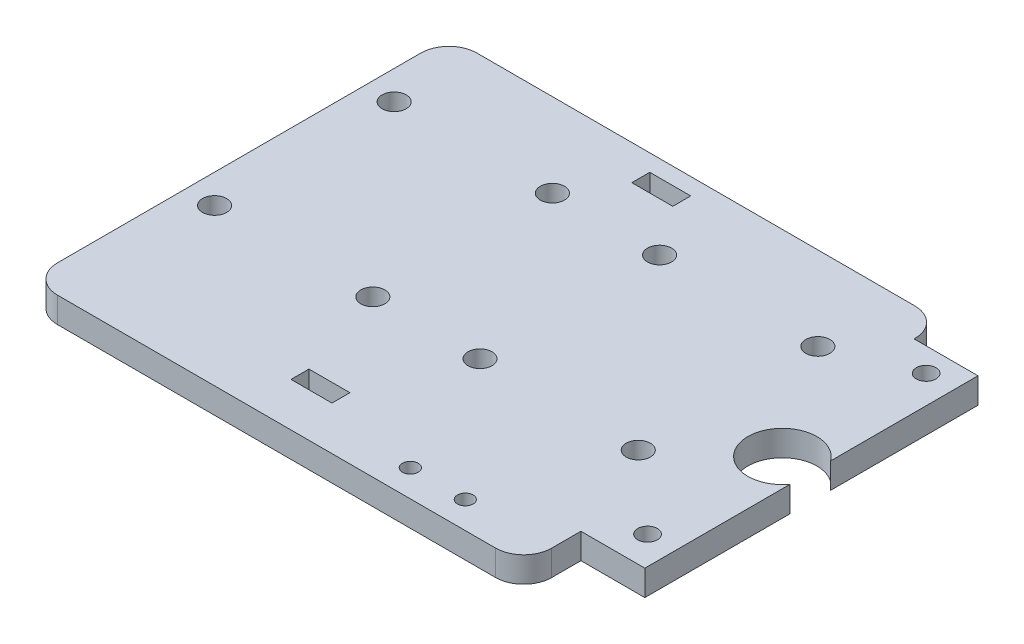
ISO-10303-21;
HEADER;
FILE_DESCRIPTION(('STEP AP214'),'2;1');
FILE_NAME('part.step','',(''),(''),'','','');
FILE_SCHEMA(('AUTOMOTIVE_DESIGN { 1 0 10303 214 1 1 1 1 }'));
ENDSEC;
DATA;
#1=APPLICATION_CONTEXT('core data for automotive mechanical design processes');
#2=APPLICATION_PROTOCOL_DEFINITION('international standard','automotive_design',2000,#1);
#3=PRODUCT_CONTEXT('',#1,'mechanical');
#4=PRODUCT('Part','Part','',(#3));
#5=PRODUCT_RELATED_PRODUCT_CATEGORY('part','',(#4));
#6=PRODUCT_DEFINITION_FORMATION('','',#4);
#7=PRODUCT_DEFINITION_CONTEXT('part definition',#1,'design');
#8=PRODUCT_DEFINITION('design','',#6,#7);
#9=PRODUCT_DEFINITION_SHAPE('','',#8);
#10=(LENGTH_UNIT() NAMED_UNIT(*) SI_UNIT(.MILLI.,.METRE.));
#11=(NAMED_UNIT(*) PLANE_ANGLE_UNIT() SI_UNIT($,.RADIAN.));
#12=(NAMED_UNIT(*) SI_UNIT($,.STERADIAN.) SOLID_ANGLE_UNIT());
#13=UNCERTAINTY_MEASURE_WITH_UNIT(LENGTH_MEASURE(1.E-05),#10,'distance_accuracy_value','');
#14=(GEOMETRIC_REPRESENTATION_CONTEXT(3) GLOBAL_UNCERTAINTY_ASSIGNED_CONTEXT((#13)) GLOBAL_UNIT_ASSIGNED_CONTEXT((#10,
#11,#12)) REPRESENTATION_CONTEXT('',''));
#15=CARTESIAN_POINT('',(0.,0.,0.));
#16=DIRECTION('',(0.,0.,1.));
#17=DIRECTION('',(1.,0.,0.));
#18=AXIS2_PLACEMENT_3D('',#15,#16,#17);
#19=CARTESIAN_POINT('',(109.36,4.55,-15.2));
#20=DIRECTION('',(0.,-1.,0.));
#21=DIRECTION('',(0.,0.,-1.));
#22=AXIS2_PLACEMENT_3D('',#19,#20,#21);
#23=PLANE('',#22);
#24=DIRECTION('',(0.,0.,1.));
#25=VECTOR('',#24,1.);
#26=CARTESIAN_POINT('',(38.8,4.55,-71.73));
#27=LINE('',#26,#25);
#28=CARTESIAN_POINT('',(38.8,4.55,-71.73));
#29=VERTEX_POINT('',#28);
#30=CARTESIAN_POINT('',(38.8,4.55,-68.53));
#31=VERTEX_POINT('',#30);
#32=EDGE_CURVE('E324',#29,#31,#27,.T.);
#33=ORIENTED_EDGE('',*,*,#32,.F.);
#34=DIRECTION('',(-1.,0.,0.));
#35=VECTOR('',#34,1.);
#36=CARTESIAN_POINT('',(38.8,4.55,-71.73));
#37=LINE('',#36,#35);
#38=CARTESIAN_POINT('',(46.1,4.55,-71.73));
#39=VERTEX_POINT('',#38);
#40=EDGE_CURVE('E332',#39,#29,#37,.T.);
#41=ORIENTED_EDGE('',*,*,#40,.F.);
#42=DIRECTION('',(0.,0.,-1.));
#43=VECTOR('',#42,1.);
#44=CARTESIAN_POINT('',(46.1,4.55,-71.73));
#45=LINE('',#44,#43);
#46=CARTESIAN_POINT('',(46.1,4.55,-68.53));
#47=VERTEX_POINT('',#46);
#48=EDGE_CURVE('E329',#47,#39,#45,.T.);
#49=ORIENTED_EDGE('',*,*,#48,.F.);
#50=DIRECTION('',(1.,0.,0.));
#51=VECTOR('',#50,1.);
#52=CARTESIAN_POINT('',(38.8,4.55,-68.53));
#53=LINE('',#52,#51);
#54=EDGE_CURVE('E326',#31,#47,#53,.T.);
#55=ORIENTED_EDGE('',*,*,#54,.F.);
#56=EDGE_LOOP('',(#33,#41,#49,#55));
#57=FACE_BOUND('',#56,.T.);
#58=CARTESIAN_POINT('',(5.15,4.55,-59.83));
#59=DIRECTION('',(0.,1.,0.));
#60=DIRECTION('',(0.,0.,1.));
#61=AXIS2_PLACEMENT_3D('',#58,#59,#60);
#62=CIRCLE('',#61,2.15);
#63=CARTESIAN_POINT('',(5.15,4.55,-57.68));
#64=VERTEX_POINT('',#63);
#65=EDGE_CURVE('E230',#64,#64,#62,.T.);
#66=ORIENTED_EDGE('',*,*,#65,.F.);
#67=EDGE_LOOP('',(#66));
#68=FACE_BOUND('',#67,.T.);
#69=CARTESIAN_POINT('',(33.35,4.55,-59.83));
#70=DIRECTION('',(0.,1.,0.));
#71=DIRECTION('',(0.,0.,1.));
#72=AXIS2_PLACEMENT_3D('',#69,#70,#71);
#73=CIRCLE('',#72,2.15000000000001);
#74=CARTESIAN_POINT('',(33.35,4.55,-57.68));
#75=VERTEX_POINT('',#74);
#76=EDGE_CURVE('E391',#75,#75,#73,.T.);
#77=ORIENTED_EDGE('',*,*,#76,.F.);
#78=EDGE_LOOP('',(#77));
#79=FACE_BOUND('',#78,.T.);
#80=CARTESIAN_POINT('',(52.45,4.55,-59.83));
#81=DIRECTION('',(0.,1.,0.));
#82=DIRECTION('',(0.,0.,1.));
#83=AXIS2_PLACEMENT_3D('',#80,#81,#82);
#84=CIRCLE('',#83,2.15);
#85=CARTESIAN_POINT('',(52.45,4.55,-57.68));
#86=VERTEX_POINT('',#85);
#87=EDGE_CURVE('E385',#86,#86,#84,.T.);
#88=ORIENTED_EDGE('',*,*,#87,.F.);
#89=EDGE_LOOP('',(#88));
#90=FACE_BOUND('',#89,.T.);
#91=CARTESIAN_POINT('',(80.65,4.55,-59.83));
#92=DIRECTION('',(0.,1.,0.));
#93=DIRECTION('',(0.,0.,1.));
#94=AXIS2_PLACEMENT_3D('',#91,#92,#93);
#95=CIRCLE('',#94,2.15);
#96=CARTESIAN_POINT('',(80.65,4.55,-57.68));
#97=VERTEX_POINT('',#96);
#98=EDGE_CURVE('E379',#97,#97,#95,.T.);
#99=ORIENTED_EDGE('',*,*,#98,.F.);
#100=EDGE_LOOP('',(#99));
#101=FACE_BOUND('',#100,.T.);
#102=CARTESIAN_POINT('',(5.15000000000034,4.55,-27.83));
#103=DIRECTION('',(0.,1.,0.));
#104=DIRECTION('',(0.,0.,1.));
#105=AXIS2_PLACEMENT_3D('',#102,#103,#104);
#106=CIRCLE('',#105,2.15);
#107=CARTESIAN_POINT('',(5.15000000000034,4.55,-25.68));
#108=VERTEX_POINT('',#107);
#109=EDGE_CURVE('E373',#108,#108,#106,.T.);
#110=ORIENTED_EDGE('',*,*,#109,.F.);
#111=EDGE_LOOP('',(#110));
#112=FACE_BOUND('',#111,.T.);
#113=CARTESIAN_POINT('',(33.3500000000003,4.55,-27.83));
#114=DIRECTION('',(0.,1.,0.));
#115=DIRECTION('',(0.,0.,1.));
#116=AXIS2_PLACEMENT_3D('',#113,#114,#115);
#117=CIRCLE('',#116,2.15000000000001);
#118=CARTESIAN_POINT('',(33.3500000000003,4.55,-25.68));
#119=VERTEX_POINT('',#118);
#120=EDGE_CURVE('E367',#119,#119,#117,.T.);
#121=ORIENTED_EDGE('',*,*,#120,.F.);
#122=EDGE_LOOP('',(#121));
#123=FACE_BOUND('',#122,.T.);
#124=CARTESIAN_POINT('',(52.4500000000003,4.55,-27.83));
#125=DIRECTION('',(0.,1.,0.));
#126=DIRECTION('',(0.,0.,1.));
#127=AXIS2_PLACEMENT_3D('',#124,#125,#126);
#128=CIRCLE('',#127,2.15);
#129=CARTESIAN_POINT('',(52.4500000000003,4.55,-25.68));
#130=VERTEX_POINT('',#129);
#131=EDGE_CURVE('E361',#130,#130,#128,.T.);
#132=ORIENTED_EDGE('',*,*,#131,.F.);
#133=EDGE_LOOP('',(#132));
#134=FACE_BOUND('',#133,.T.);
#135=CARTESIAN_POINT('',(80.6500000000003,4.55,-27.83));
#136=DIRECTION('',(0.,1.,0.));
#137=DIRECTION('',(0.,0.,1.));
#138=AXIS2_PLACEMENT_3D('',#135,#136,#137);
#139=CIRCLE('',#138,2.15);
#140=CARTESIAN_POINT('',(80.6500000000003,4.55,-25.68));
#141=VERTEX_POINT('',#140);
#142=EDGE_CURVE('E355',#141,#141,#139,.T.);
#143=ORIENTED_EDGE('',*,*,#142,.F.);
#144=EDGE_LOOP('',(#143));
#145=FACE_BOUND('',#144,.T.);
#146=DIRECTION('',(0.,0.,1.));
#147=VECTOR('',#146,1.);
#148=CARTESIAN_POINT('',(38.8,4.55,-11.));
#149=LINE('',#148,#147);
#150=CARTESIAN_POINT('',(38.8,4.55,-11.));
#151=VERTEX_POINT('',#150);
#152=CARTESIAN_POINT('',(38.8,4.55,-7.8));
#153=VERTEX_POINT('',#152);
#154=EDGE_CURVE('E296',#151,#153,#149,.T.);
#155=ORIENTED_EDGE('',*,*,#154,.F.);
#156=DIRECTION('',(-1.,0.,0.));
#157=VECTOR('',#156,1.);
#158=CARTESIAN_POINT('',(38.8,4.55,-11.));
#159=LINE('',#158,#157);
#160=CARTESIAN_POINT('',(46.1,4.55,-11.));
#161=VERTEX_POINT('',#160);
#162=EDGE_CURVE('E304',#161,#151,#159,.T.);
#163=ORIENTED_EDGE('',*,*,#162,.F.);
#164=DIRECTION('',(0.,0.,-1.));
#165=VECTOR('',#164,1.);
#166=CARTESIAN_POINT('',(46.1,4.55,-11.));
#167=LINE('',#166,#165);
#168=CARTESIAN_POINT('',(46.1,4.55,-7.8));
#169=VERTEX_POINT('',#168);
#170=EDGE_CURVE('E301',#169,#161,#167,.T.);
#171=ORIENTED_EDGE('',*,*,#170,.F.);
#172=DIRECTION('',(1.,0.,0.));
#173=VECTOR('',#172,1.);
#174=CARTESIAN_POINT('',(38.8,4.55,-7.8));
#175=LINE('',#174,#173);
#176=EDGE_CURVE('E298',#153,#169,#175,.T.);
#177=ORIENTED_EDGE('',*,*,#176,.F.);
#178=EDGE_LOOP('',(#155,#163,#171,#177));
#179=FACE_BOUND('',#178,.T.);
#180=DIRECTION('',(1.,0.,0.));
#181=VECTOR('',#180,1.);
#182=CARTESIAN_POINT('',(109.36,4.55,-10.2));
#183=LINE('',#182,#181);
#184=CARTESIAN_POINT('',(88.06,4.55,-10.2));
#185=VERTEX_POINT('',#184);
#186=CARTESIAN_POINT('',(99.4499999999995,4.55,-10.2));
#187=VERTEX_POINT('',#186);
#188=EDGE_CURVE('E204',#185,#187,#183,.T.);
#189=ORIENTED_EDGE('',*,*,#188,.T.);
#190=DIRECTION('',(0.,0.,1.));
#191=VECTOR('',#190,1.);
#192=CARTESIAN_POINT('',(99.4499999999995,4.55,0.));
#193=LINE('',#192,#191);
#194=CARTESIAN_POINT('',(99.4499999999995,4.55,-36.0813853073506));
#195=VERTEX_POINT('',#194);
#196=EDGE_CURVE('E197',#195,#187,#193,.T.);
#197=ORIENTED_EDGE('',*,*,#196,.F.);
#198=CARTESIAN_POINT('',(94.47,4.55,-39.69));
#199=DIRECTION('',(0.,1.,0.));
#200=DIRECTION('',(0.,0.,1.));
#201=AXIS2_PLACEMENT_3D('',#198,#199,#200);
#202=CIRCLE('',#201,6.15000000000001);
#203=CARTESIAN_POINT('',(99.4499999999995,4.55,-43.2986146926494));
#204=VERTEX_POINT('',#203);
#205=EDGE_CURVE('E196',#204,#195,#202,.T.);
#206=ORIENTED_EDGE('',*,*,#205,.F.);
#207=CARTESIAN_POINT('',(99.4499999999995,4.55,-69.57));
#208=VERTEX_POINT('',#207);
#209=EDGE_CURVE('E55',#208,#204,#193,.T.);
#210=ORIENTED_EDGE('',*,*,#209,.F.);
#211=DIRECTION('',(-1.,0.,0.));
#212=VECTOR('',#211,1.);
#213=CARTESIAN_POINT('',(88.06,4.55,-69.57));
#214=LINE('',#213,#212);
#215=CARTESIAN_POINT('',(88.06,4.55,-69.57));
#216=VERTEX_POINT('',#215);
#217=EDGE_CURVE('E192',#208,#216,#214,.T.);
#218=ORIENTED_EDGE('',*,*,#217,.T.);
#219=DIRECTION('',(0.,0.,-1.));
#220=VECTOR('',#219,1.);
#221=CARTESIAN_POINT('',(88.06,4.55,-69.57));
#222=LINE('',#221,#220);
#223=CARTESIAN_POINT('',(88.06,4.55,-69.73));
#224=VERTEX_POINT('',#223);
#225=EDGE_CURVE('E203',#216,#224,#222,.T.);
#226=ORIENTED_EDGE('',*,*,#225,.T.);
#227=CARTESIAN_POINT('',(83.06,4.55,-69.73));
#228=DIRECTION('',(0.,1.,0.));
#229=DIRECTION('',(0.,0.,1.));
#230=AXIS2_PLACEMENT_3D('',#227,#228,#229);
#231=CIRCLE('',#230,5.);
#232=CARTESIAN_POINT('',(83.06,4.55,-74.73));
#233=VERTEX_POINT('',#232);
#234=EDGE_CURVE('E206',#224,#233,#231,.T.);
#235=ORIENTED_EDGE('',*,*,#234,.T.);
#236=DIRECTION('',(-1.,0.,0.));
#237=VECTOR('',#236,1.);
#238=CARTESIAN_POINT('',(5.00000000000004,4.55,-74.73));
#239=LINE('',#238,#237);
#240=CARTESIAN_POINT('',(5.00000000000004,4.55,-74.73));
#241=VERTEX_POINT('',#240);
#242=EDGE_CURVE('E213',#233,#241,#239,.T.);
#243=ORIENTED_EDGE('',*,*,#242,.T.);
#244=CARTESIAN_POINT('',(5.,4.55,-69.73));
#245=DIRECTION('',(0.,1.,0.));
#246=DIRECTION('',(0.,0.,-1.));
#247=AXIS2_PLACEMENT_3D('',#244,#245,#246);
#248=CIRCLE('',#247,5.);
#249=CARTESIAN_POINT('',(0.,4.55,-69.73));
#250=VERTEX_POINT('',#249);
#251=EDGE_CURVE('E215',#241,#250,#248,.T.);
#252=ORIENTED_EDGE('',*,*,#251,.T.);
#253=DIRECTION('',(0.,0.,1.));
#254=VECTOR('',#253,1.);
#255=CARTESIAN_POINT('',(0.,4.55,-5.00000000000004));
#256=LINE('',#255,#254);
#257=CARTESIAN_POINT('',(0.,4.55,-5.00000000000004));
#258=VERTEX_POINT('',#257);
#259=EDGE_CURVE('E217',#250,#258,#256,.T.);
#260=ORIENTED_EDGE('',*,*,#259,.T.);
#261=CARTESIAN_POINT('',(5.,4.55,-5.));
#262=DIRECTION('',(0.,1.,0.));
#263=DIRECTION('',(0.,0.,-1.));
#264=AXIS2_PLACEMENT_3D('',#261,#262,#263);
#265=CIRCLE('',#264,5.);
#266=CARTESIAN_POINT('',(5.00000000000004,4.55,0.));
#267=VERTEX_POINT('',#266);
#268=EDGE_CURVE('E219',#258,#267,#265,.T.);
#269=ORIENTED_EDGE('',*,*,#268,.T.);
#270=DIRECTION('',(1.,0.,0.));
#271=VECTOR('',#270,1.);
#272=CARTESIAN_POINT('',(5.00000000000004,4.55,0.));
#273=LINE('',#272,#271);
#274=CARTESIAN_POINT('',(83.06,4.55,0.));
#275=VERTEX_POINT('',#274);
#276=EDGE_CURVE('E221',#267,#275,#273,.T.);
#277=ORIENTED_EDGE('',*,*,#276,.T.);
#278=CARTESIAN_POINT('',(83.06,4.55,-5.));
#279=DIRECTION('',(0.,1.,0.));
#280=DIRECTION('',(0.,0.,1.));
#281=AXIS2_PLACEMENT_3D('',#278,#279,#280);
#282=CIRCLE('',#281,5.);
#283=CARTESIAN_POINT('',(88.06,4.55,-5.00000000000004));
#284=VERTEX_POINT('',#283);
#285=EDGE_CURVE('E223',#275,#284,#282,.T.);
#286=ORIENTED_EDGE('',*,*,#285,.T.);
#287=DIRECTION('',(0.,0.,-1.));
#288=VECTOR('',#287,1.);
#289=CARTESIAN_POINT('',(88.06,4.55,-5.00000000000004));
#290=LINE('',#289,#288);
#291=EDGE_CURVE('E208',#284,#185,#290,.T.);
#292=ORIENTED_EDGE('',*,*,#291,.T.);
#293=EDGE_LOOP('',(#189,#197,#206,#210,#218,#226,#235,#243,#252,#260,#269,#277,#286,#292));
#294=FACE_BOUND('',#293,.T.);
#295=CARTESIAN_POINT('',(94.4499999999995,4.55,-65.33));
#296=DIRECTION('',(0.,1.,0.));
#297=DIRECTION('',(0.,0.,1.));
#298=AXIS2_PLACEMENT_3D('',#295,#296,#297);
#299=CIRCLE('',#298,1.75);
#300=CARTESIAN_POINT('',(94.4499999999995,4.55,-63.58));
#301=VERTEX_POINT('',#300);
#302=EDGE_CURVE('E290',#301,#301,#299,.T.);
#303=ORIENTED_EDGE('',*,*,#302,.F.);
#304=EDGE_LOOP('',(#303));
#305=FACE_BOUND('',#304,.T.);
#306=CARTESIAN_POINT('',(94.45,4.55,-15.69));
#307=DIRECTION('',(0.,1.,0.));
#308=DIRECTION('',(0.,0.,1.));
#309=AXIS2_PLACEMENT_3D('',#306,#307,#308);
#310=CIRCLE('',#309,1.75);
#311=CARTESIAN_POINT('',(94.45,4.55,-13.94));
#312=VERTEX_POINT('',#311);
#313=EDGE_CURVE('E423',#312,#312,#310,.T.);
#314=ORIENTED_EDGE('',*,*,#313,.F.);
#315=EDGE_LOOP('',(#314));
#316=FACE_BOUND('',#315,.T.);
#317=CARTESIAN_POINT('',(63.06,4.55,-4.8));
#318=DIRECTION('',(0.,1.,0.));
#319=DIRECTION('',(0.,0.,1.));
#320=AXIS2_PLACEMENT_3D('',#317,#318,#319);
#321=CIRCLE('',#320,1.4);
#322=CARTESIAN_POINT('',(63.06,4.55,-3.4));
#323=VERTEX_POINT('',#322);
#324=EDGE_CURVE('E417',#323,#323,#321,.T.);
#325=ORIENTED_EDGE('',*,*,#324,.F.);
#326=EDGE_LOOP('',(#325));
#327=FACE_BOUND('',#326,.T.);
#328=CARTESIAN_POINT('',(72.86,4.55,-4.8));
#329=DIRECTION('',(0.,1.,0.));
#330=DIRECTION('',(0.,0.,1.));
#331=AXIS2_PLACEMENT_3D('',#328,#329,#330);
#332=CIRCLE('',#331,1.4);
#333=CARTESIAN_POINT('',(72.86,4.55,-3.4));
#334=VERTEX_POINT('',#333);
#335=EDGE_CURVE('E411',#334,#334,#332,.T.);
#336=ORIENTED_EDGE('',*,*,#335,.F.);
#337=EDGE_LOOP('',(#336));
#338=FACE_BOUND('',#337,.T.);
#339=ADVANCED_FACE('F33',(#57,#68,#79,#90,#101,#112,#123,#134,#145,#179,#294,#305,#316,#327,
#338),#23,.F.);
#340=CARTESIAN_POINT('',(109.36,0.,-15.2));
#341=DIRECTION('',(0.,-1.,0.));
#342=DIRECTION('',(0.,0.,-1.));
#343=AXIS2_PLACEMENT_3D('',#340,#341,#342);
#344=PLANE('',#343);
#345=DIRECTION('',(0.,0.,1.));
#346=VECTOR('',#345,1.);
#347=CARTESIAN_POINT('',(99.4499999999995,0.,0.));
#348=LINE('',#347,#346);
#349=CARTESIAN_POINT('',(99.4499999999995,0.,-36.0813853073506));
#350=VERTEX_POINT('',#349);
#351=CARTESIAN_POINT('',(99.4499999999995,0.,-10.2));
#352=VERTEX_POINT('',#351);
#353=EDGE_CURVE('E48',#350,#352,#348,.T.);
#354=ORIENTED_EDGE('',*,*,#353,.T.);
#355=DIRECTION('',(1.,0.,0.));
#356=VECTOR('',#355,1.);
#357=CARTESIAN_POINT('',(109.36,0.,-10.2));
#358=LINE('',#357,#356);
#359=CARTESIAN_POINT('',(88.06,0.,-10.2));
#360=VERTEX_POINT('',#359);
#361=EDGE_CURVE('E229',#360,#352,#358,.T.);
#362=ORIENTED_EDGE('',*,*,#361,.F.);
#363=DIRECTION('',(0.,0.,-1.));
#364=VECTOR('',#363,1.);
#365=CARTESIAN_POINT('',(88.06,0.,-5.00000000000004));
#366=LINE('',#365,#364);
#367=CARTESIAN_POINT('',(88.06,0.,-5.00000000000004));
#368=VERTEX_POINT('',#367);
#369=EDGE_CURVE('E226',#368,#360,#366,.T.);
#370=ORIENTED_EDGE('',*,*,#369,.F.);
#371=CARTESIAN_POINT('',(83.06,0.,-5.));
#372=DIRECTION('',(0.,1.,0.));
#373=DIRECTION('',(0.,0.,1.));
#374=AXIS2_PLACEMENT_3D('',#371,#372,#373);
#375=CIRCLE('',#374,5.);
#376=CARTESIAN_POINT('',(83.06,0.,0.));
#377=VERTEX_POINT('',#376);
#378=EDGE_CURVE('E249',#377,#368,#375,.T.);
#379=ORIENTED_EDGE('',*,*,#378,.F.);
#380=DIRECTION('',(1.,0.,0.));
#381=VECTOR('',#380,1.);
#382=CARTESIAN_POINT('',(5.00000000000004,0.,0.));
#383=LINE('',#382,#381);
#384=CARTESIAN_POINT('',(5.00000000000004,0.,0.));
#385=VERTEX_POINT('',#384);
#386=EDGE_CURVE('E247',#385,#377,#383,.T.);
#387=ORIENTED_EDGE('',*,*,#386,.F.);
#388=CARTESIAN_POINT('',(5.,0.,-5.));
#389=DIRECTION('',(0.,1.,0.));
#390=DIRECTION('',(0.,0.,-1.));
#391=AXIS2_PLACEMENT_3D('',#388,#389,#390);
#392=CIRCLE('',#391,5.);
#393=CARTESIAN_POINT('',(0.,0.,-5.00000000000004));
#394=VERTEX_POINT('',#393);
#395=EDGE_CURVE('E245',#394,#385,#392,.T.);
#396=ORIENTED_EDGE('',*,*,#395,.F.);
#397=DIRECTION('',(0.,0.,1.));
#398=VECTOR('',#397,1.);
#399=CARTESIAN_POINT('',(0.,0.,-5.00000000000004));
#400=LINE('',#399,#398);
#401=CARTESIAN_POINT('',(0.,0.,-69.73));
#402=VERTEX_POINT('',#401);
#403=EDGE_CURVE('E243',#402,#394,#400,.T.);
#404=ORIENTED_EDGE('',*,*,#403,.F.);
#405=CARTESIAN_POINT('',(5.,0.,-69.73));
#406=DIRECTION('',(0.,1.,0.));
#407=DIRECTION('',(0.,0.,-1.));
#408=AXIS2_PLACEMENT_3D('',#405,#406,#407);
#409=CIRCLE('',#408,5.);
#410=CARTESIAN_POINT('',(5.00000000000004,0.,-74.73));
#411=VERTEX_POINT('',#410);
#412=EDGE_CURVE('E241',#411,#402,#409,.T.);
#413=ORIENTED_EDGE('',*,*,#412,.F.);
#414=DIRECTION('',(-1.,0.,0.));
#415=VECTOR('',#414,1.);
#416=CARTESIAN_POINT('',(5.00000000000004,0.,-74.73));
#417=LINE('',#416,#415);
#418=CARTESIAN_POINT('',(83.06,0.,-74.73));
#419=VERTEX_POINT('',#418);
#420=EDGE_CURVE('E239',#419,#411,#417,.T.);
#421=ORIENTED_EDGE('',*,*,#420,.F.);
#422=CARTESIAN_POINT('',(83.06,0.,-69.73));
#423=DIRECTION('',(0.,1.,0.));
#424=DIRECTION('',(0.,0.,1.));
#425=AXIS2_PLACEMENT_3D('',#422,#423,#424);
#426=CIRCLE('',#425,5.);
#427=CARTESIAN_POINT('',(88.06,0.,-69.73));
#428=VERTEX_POINT('',#427);
#429=EDGE_CURVE('E237',#428,#419,#426,.T.);
#430=ORIENTED_EDGE('',*,*,#429,.F.);
#431=DIRECTION('',(0.,0.,-1.));
#432=VECTOR('',#431,1.);
#433=CARTESIAN_POINT('',(88.06,0.,-69.57));
#434=LINE('',#433,#432);
#435=CARTESIAN_POINT('',(88.06,0.,-69.57));
#436=VERTEX_POINT('',#435);
#437=EDGE_CURVE('E235',#436,#428,#434,.T.);
#438=ORIENTED_EDGE('',*,*,#437,.F.);
#439=DIRECTION('',(-1.,0.,0.));
#440=VECTOR('',#439,1.);
#441=CARTESIAN_POINT('',(88.06,0.,-69.57));
#442=LINE('',#441,#440);
#443=CARTESIAN_POINT('',(99.4499999999995,0.,-69.57));
#444=VERTEX_POINT('',#443);
#445=EDGE_CURVE('E233',#444,#436,#442,.T.);
#446=ORIENTED_EDGE('',*,*,#445,.F.);
#447=CARTESIAN_POINT('',(99.4499999999995,0.,-43.2986146926494));
#448=VERTEX_POINT('',#447);
#449=EDGE_CURVE('E182',#444,#448,#348,.T.);
#450=ORIENTED_EDGE('',*,*,#449,.T.);
#451=CARTESIAN_POINT('',(94.47,0.,-39.69));
#452=DIRECTION('',(0.,1.,0.));
#453=DIRECTION('',(0.,0.,1.));
#454=AXIS2_PLACEMENT_3D('',#451,#452,#453);
#455=CIRCLE('',#454,6.15000000000001);
#456=EDGE_CURVE('E285',#448,#350,#455,.T.);
#457=ORIENTED_EDGE('',*,*,#456,.T.);
#458=EDGE_LOOP('',(#354,#362,#370,#379,#387,#396,#404,#413,#421,#430,#438,#446,#450,#457));
#459=FACE_BOUND('',#458,.T.);
#460=CARTESIAN_POINT('',(63.06,0.,-4.8));
#461=DIRECTION('',(0.,1.,0.));
#462=DIRECTION('',(0.,0.,1.));
#463=AXIS2_PLACEMENT_3D('',#460,#461,#462);
#464=CIRCLE('',#463,1.4);
#465=CARTESIAN_POINT('',(63.06,0.,-3.4));
#466=VERTEX_POINT('',#465);
#467=EDGE_CURVE('E415',#466,#466,#464,.T.);
#468=ORIENTED_EDGE('',*,*,#467,.T.);
#469=EDGE_LOOP('',(#468));
#470=FACE_BOUND('',#469,.T.);
#471=CARTESIAN_POINT('',(94.4499999999995,0.,-65.33));
#472=DIRECTION('',(0.,1.,0.));
#473=DIRECTION('',(0.,0.,1.));
#474=AXIS2_PLACEMENT_3D('',#471,#472,#473);
#475=CIRCLE('',#474,1.75);
#476=CARTESIAN_POINT('',(94.4499999999995,0.,-63.58));
#477=VERTEX_POINT('',#476);
#478=EDGE_CURVE('E293',#477,#477,#475,.T.);
#479=ORIENTED_EDGE('',*,*,#478,.T.);
#480=EDGE_LOOP('',(#479));
#481=FACE_BOUND('',#480,.T.);
#482=DIRECTION('',(-1.,0.,0.));
#483=VECTOR('',#482,1.);
#484=CARTESIAN_POINT('',(38.8,0.,-11.));
#485=LINE('',#484,#483);
#486=CARTESIAN_POINT('',(46.1,0.,-11.));
#487=VERTEX_POINT('',#486);
#488=CARTESIAN_POINT('',(38.8,0.,-11.));
#489=VERTEX_POINT('',#488);
#490=EDGE_CURVE('E299',#487,#489,#485,.T.);
#491=ORIENTED_EDGE('',*,*,#490,.T.);
#492=DIRECTION('',(0.,0.,1.));
#493=VECTOR('',#492,1.);
#494=CARTESIAN_POINT('',(38.8,0.,-11.));
#495=LINE('',#494,#493);
#496=CARTESIAN_POINT('',(38.8,0.,-7.8));
#497=VERTEX_POINT('',#496);
#498=EDGE_CURVE('E284',#489,#497,#495,.T.);
#499=ORIENTED_EDGE('',*,*,#498,.T.);
#500=DIRECTION('',(1.,0.,0.));
#501=VECTOR('',#500,1.);
#502=CARTESIAN_POINT('',(38.8,0.,-7.8));
#503=LINE('',#502,#501);
#504=CARTESIAN_POINT('',(46.1,0.,-7.8));
#505=VERTEX_POINT('',#504);
#506=EDGE_CURVE('E288',#497,#505,#503,.T.);
#507=ORIENTED_EDGE('',*,*,#506,.T.);
#508=DIRECTION('',(0.,0.,-1.));
#509=VECTOR('',#508,1.);
#510=CARTESIAN_POINT('',(46.1,0.,-11.));
#511=LINE('',#510,#509);
#512=EDGE_CURVE('E309',#505,#487,#511,.T.);
#513=ORIENTED_EDGE('',*,*,#512,.T.);
#514=EDGE_LOOP('',(#491,#499,#507,#513));
#515=FACE_BOUND('',#514,.T.);
#516=DIRECTION('',(-1.,0.,0.));
#517=VECTOR('',#516,1.);
#518=CARTESIAN_POINT('',(38.8,0.,-71.73));
#519=LINE('',#518,#517);
#520=CARTESIAN_POINT('',(46.1,0.,-71.73));
#521=VERTEX_POINT('',#520);
#522=CARTESIAN_POINT('',(38.8,0.,-71.73));
#523=VERTEX_POINT('',#522);
#524=EDGE_CURVE('E327',#521,#523,#519,.T.);
#525=ORIENTED_EDGE('',*,*,#524,.T.);
#526=DIRECTION('',(0.,0.,1.));
#527=VECTOR('',#526,1.);
#528=CARTESIAN_POINT('',(38.8,0.,-71.73));
#529=LINE('',#528,#527);
#530=CARTESIAN_POINT('',(38.8,0.,-68.53));
#531=VERTEX_POINT('',#530);
#532=EDGE_CURVE('E323',#523,#531,#529,.T.);
#533=ORIENTED_EDGE('',*,*,#532,.T.);
#534=DIRECTION('',(1.,0.,0.));
#535=VECTOR('',#534,1.);
#536=CARTESIAN_POINT('',(38.8,0.,-68.53));
#537=LINE('',#536,#535);
#538=CARTESIAN_POINT('',(46.1,0.,-68.53));
#539=VERTEX_POINT('',#538);
#540=EDGE_CURVE('E337',#531,#539,#537,.T.);
#541=ORIENTED_EDGE('',*,*,#540,.T.);
#542=DIRECTION('',(0.,0.,-1.));
#543=VECTOR('',#542,1.);
#544=CARTESIAN_POINT('',(46.1,0.,-71.73));
#545=LINE('',#544,#543);
#546=EDGE_CURVE('E340',#539,#521,#545,.T.);
#547=ORIENTED_EDGE('',*,*,#546,.T.);
#548=EDGE_LOOP('',(#525,#533,#541,#547));
#549=FACE_BOUND('',#548,.T.);
#550=CARTESIAN_POINT('',(80.6500000000003,0.,-27.83));
#551=DIRECTION('',(0.,1.,0.));
#552=DIRECTION('',(0.,0.,1.));
#553=AXIS2_PLACEMENT_3D('',#550,#551,#552);
#554=CIRCLE('',#553,2.15);
#555=CARTESIAN_POINT('',(80.6500000000003,0.,-25.68));
#556=VERTEX_POINT('',#555);
#557=EDGE_CURVE('E354',#556,#556,#554,.T.);
#558=ORIENTED_EDGE('',*,*,#557,.T.);
#559=EDGE_LOOP('',(#558));
#560=FACE_BOUND('',#559,.T.);
#561=CARTESIAN_POINT('',(33.3500000000003,0.,-27.83));
#562=DIRECTION('',(0.,1.,0.));
#563=DIRECTION('',(0.,0.,1.));
#564=AXIS2_PLACEMENT_3D('',#561,#562,#563);
#565=CIRCLE('',#564,2.15000000000001);
#566=CARTESIAN_POINT('',(33.3500000000003,0.,-25.68));
#567=VERTEX_POINT('',#566);
#568=EDGE_CURVE('E364',#567,#567,#565,.T.);
#569=ORIENTED_EDGE('',*,*,#568,.T.);
#570=EDGE_LOOP('',(#569));
#571=FACE_BOUND('',#570,.T.);
#572=CARTESIAN_POINT('',(80.65,0.,-59.83));
#573=DIRECTION('',(0.,1.,0.));
#574=DIRECTION('',(0.,0.,1.));
#575=AXIS2_PLACEMENT_3D('',#572,#573,#574);
#576=CIRCLE('',#575,2.15);
#577=CARTESIAN_POINT('',(80.65,0.,-57.68));
#578=VERTEX_POINT('',#577);
#579=EDGE_CURVE('E376',#578,#578,#576,.T.);
#580=ORIENTED_EDGE('',*,*,#579,.T.);
#581=EDGE_LOOP('',(#580));
#582=FACE_BOUND('',#581,.T.);
#583=CARTESIAN_POINT('',(33.35,0.,-59.83));
#584=DIRECTION('',(0.,1.,0.));
#585=DIRECTION('',(0.,0.,1.));
#586=AXIS2_PLACEMENT_3D('',#583,#584,#585);
#587=CIRCLE('',#586,2.15000000000001);
#588=CARTESIAN_POINT('',(33.35,0.,-57.68));
#589=VERTEX_POINT('',#588);
#590=EDGE_CURVE('E388',#589,#589,#587,.T.);
#591=ORIENTED_EDGE('',*,*,#590,.T.);
#592=EDGE_LOOP('',(#591));
#593=FACE_BOUND('',#592,.T.);
#594=CARTESIAN_POINT('',(5.15,0.,-59.83));
#595=DIRECTION('',(0.,1.,0.));
#596=DIRECTION('',(0.,0.,1.));
#597=AXIS2_PLACEMENT_3D('',#594,#595,#596);
#598=CIRCLE('',#597,2.15);
#599=CARTESIAN_POINT('',(5.15,0.,-57.68));
#600=VERTEX_POINT('',#599);
#601=EDGE_CURVE('E394',#600,#600,#598,.T.);
#602=ORIENTED_EDGE('',*,*,#601,.T.);
#603=EDGE_LOOP('',(#602));
#604=FACE_BOUND('',#603,.T.);
#605=CARTESIAN_POINT('',(52.45,0.,-59.83));
#606=DIRECTION('',(0.,1.,0.));
#607=DIRECTION('',(0.,0.,1.));
#608=AXIS2_PLACEMENT_3D('',#605,#606,#607);
#609=CIRCLE('',#608,2.15);
#610=CARTESIAN_POINT('',(52.45,0.,-57.68));
#611=VERTEX_POINT('',#610);
#612=EDGE_CURVE('E382',#611,#611,#609,.T.);
#613=ORIENTED_EDGE('',*,*,#612,.T.);
#614=EDGE_LOOP('',(#613));
#615=FACE_BOUND('',#614,.T.);
#616=CARTESIAN_POINT('',(5.15000000000034,0.,-27.83));
#617=DIRECTION('',(0.,1.,0.));
#618=DIRECTION('',(0.,0.,1.));
#619=AXIS2_PLACEMENT_3D('',#616,#617,#618);
#620=CIRCLE('',#619,2.15);
#621=CARTESIAN_POINT('',(5.15000000000034,0.,-25.68));
#622=VERTEX_POINT('',#621);
#623=EDGE_CURVE('E370',#622,#622,#620,.T.);
#624=ORIENTED_EDGE('',*,*,#623,.T.);
#625=EDGE_LOOP('',(#624));
#626=FACE_BOUND('',#625,.T.);
#627=CARTESIAN_POINT('',(52.4500000000003,0.,-27.83));
#628=DIRECTION('',(0.,1.,0.));
#629=DIRECTION('',(0.,0.,1.));
#630=AXIS2_PLACEMENT_3D('',#627,#628,#629);
#631=CIRCLE('',#630,2.15);
#632=CARTESIAN_POINT('',(52.4500000000003,0.,-25.68));
#633=VERTEX_POINT('',#632);
#634=EDGE_CURVE('E358',#633,#633,#631,.T.);
#635=ORIENTED_EDGE('',*,*,#634,.T.);
#636=EDGE_LOOP('',(#635));
#637=FACE_BOUND('',#636,.T.);
#638=CARTESIAN_POINT('',(94.45,0.,-15.69));
#639=DIRECTION('',(0.,1.,0.));
#640=DIRECTION('',(0.,0.,1.));
#641=AXIS2_PLACEMENT_3D('',#638,#639,#640);
#642=CIRCLE('',#641,1.75);
#643=CARTESIAN_POINT('',(94.45,0.,-13.94));
#644=VERTEX_POINT('',#643);
#645=EDGE_CURVE('E420',#644,#644,#642,.T.);
#646=ORIENTED_EDGE('',*,*,#645,.T.);
#647=EDGE_LOOP('',(#646));
#648=FACE_BOUND('',#647,.T.);
#649=CARTESIAN_POINT('',(72.86,0.,-4.8));
#650=DIRECTION('',(0.,1.,0.));
#651=DIRECTION('',(0.,0.,1.));
#652=AXIS2_PLACEMENT_3D('',#649,#650,#651);
#653=CIRCLE('',#652,1.4);
#654=CARTESIAN_POINT('',(72.86,0.,-3.4));
#655=VERTEX_POINT('',#654);
#656=EDGE_CURVE('E408',#655,#655,#653,.T.);
#657=ORIENTED_EDGE('',*,*,#656,.T.);
#658=EDGE_LOOP('',(#657));
#659=FACE_BOUND('',#658,.T.);
#660=ADVANCED_FACE('F433',(#459,#470,#481,#515,#549,#560,#571,#582,#593,#604,#615,#626,#637,
#648,#659),#344,.T.);
#661=CARTESIAN_POINT('',(88.06,4.55,-5.00000000000004));
#662=DIRECTION('',(-1.,0.,0.));
#663=DIRECTION('',(0.,0.,1.));
#664=AXIS2_PLACEMENT_3D('',#661,#662,#663);
#665=PLANE('',#664);
#666=ORIENTED_EDGE('',*,*,#369,.T.);
#667=DIRECTION('',(0.,-1.,0.));
#668=VECTOR('',#667,1.);
#669=CARTESIAN_POINT('',(88.06,4.55,-10.2));
#670=LINE('',#669,#668);
#671=EDGE_CURVE('E275',#185,#360,#670,.T.);
#672=ORIENTED_EDGE('',*,*,#671,.F.);
#673=ORIENTED_EDGE('',*,*,#291,.F.);
#674=DIRECTION('',(0.,-1.,0.));
#675=VECTOR('',#674,1.);
#676=CARTESIAN_POINT('',(88.06,4.55,-5.00000000000004));
#677=LINE('',#676,#675);
#678=EDGE_CURVE('E225',#284,#368,#677,.T.);
#679=ORIENTED_EDGE('',*,*,#678,.T.);
#680=EDGE_LOOP('',(#666,#672,#673,#679));
#681=FACE_BOUND('',#680,.T.);
#682=ADVANCED_FACE('F35',(#681),#665,.F.);
#683=CARTESIAN_POINT('',(109.36,4.55,-10.2));
#684=DIRECTION('',(0.,0.,-1.));
#685=DIRECTION('',(-1.,0.,0.));
#686=AXIS2_PLACEMENT_3D('',#683,#684,#685);
#687=PLANE('',#686);
#688=ORIENTED_EDGE('',*,*,#361,.T.);
#689=DIRECTION('',(0.,1.,0.));
#690=VECTOR('',#689,1.);
#691=CARTESIAN_POINT('',(99.4499999999995,4.55,-10.2));
#692=LINE('',#691,#690);
#693=EDGE_CURVE('E186',#352,#187,#692,.T.);
#694=ORIENTED_EDGE('',*,*,#693,.T.);
#695=ORIENTED_EDGE('',*,*,#188,.F.);
#696=ORIENTED_EDGE('',*,*,#671,.T.);
#697=EDGE_LOOP('',(#688,#694,#695,#696));
#698=FACE_BOUND('',#697,.T.);
#699=ADVANCED_FACE('F407',(#698),#687,.F.);
#700=CARTESIAN_POINT('',(88.06,4.55,-69.57));
#701=DIRECTION('',(0.,0.,1.));
#702=DIRECTION('',(1.,0.,0.));
#703=AXIS2_PLACEMENT_3D('',#700,#701,#702);
#704=PLANE('',#703);
#705=ORIENTED_EDGE('',*,*,#217,.F.);
#706=DIRECTION('',(0.,-1.,0.));
#707=VECTOR('',#706,1.);
#708=CARTESIAN_POINT('',(99.4499999999995,4.55,-69.57));
#709=LINE('',#708,#707);
#710=EDGE_CURVE('E179',#208,#444,#709,.T.);
#711=ORIENTED_EDGE('',*,*,#710,.T.);
#712=ORIENTED_EDGE('',*,*,#445,.T.);
#713=DIRECTION('',(0.,-1.,0.));
#714=VECTOR('',#713,1.);
#715=CARTESIAN_POINT('',(88.06,4.55,-69.57));
#716=LINE('',#715,#714);
#717=EDGE_CURVE('E201',#216,#436,#716,.T.);
#718=ORIENTED_EDGE('',*,*,#717,.F.);
#719=EDGE_LOOP('',(#705,#711,#712,#718));
#720=FACE_BOUND('',#719,.T.);
#721=ADVANCED_FACE('F199',(#720),#704,.F.);
#722=CARTESIAN_POINT('',(88.06,4.55,-69.57));
#723=DIRECTION('',(-1.,0.,0.));
#724=DIRECTION('',(0.,0.,1.));
#725=AXIS2_PLACEMENT_3D('',#722,#723,#724);
#726=PLANE('',#725);
#727=ORIENTED_EDGE('',*,*,#437,.T.);
#728=DIRECTION('',(0.,-1.,0.));
#729=VECTOR('',#728,1.);
#730=CARTESIAN_POINT('',(88.06,4.55,-69.73));
#731=LINE('',#730,#729);
#732=EDGE_CURVE('E271',#224,#428,#731,.T.);
#733=ORIENTED_EDGE('',*,*,#732,.F.);
#734=ORIENTED_EDGE('',*,*,#225,.F.);
#735=ORIENTED_EDGE('',*,*,#717,.T.);
#736=EDGE_LOOP('',(#727,#733,#734,#735));
#737=FACE_BOUND('',#736,.T.);
#738=ADVANCED_FACE('F490',(#737),#726,.F.);
#739=CARTESIAN_POINT('',(83.06,4.55,-69.73));
#740=DIRECTION('',(0.,-1.,0.));
#741=DIRECTION('',(0.,0.,-1.));
#742=AXIS2_PLACEMENT_3D('',#739,#740,#741);
#743=CYLINDRICAL_SURFACE('',#742,5.);
#744=ORIENTED_EDGE('',*,*,#429,.T.);
#745=DIRECTION('',(0.,-1.,0.));
#746=VECTOR('',#745,1.);
#747=CARTESIAN_POINT('',(83.06,4.55,-74.73));
#748=LINE('',#747,#746);
#749=EDGE_CURVE('E268',#233,#419,#748,.T.);
#750=ORIENTED_EDGE('',*,*,#749,.F.);
#751=ORIENTED_EDGE('',*,*,#234,.F.);
#752=ORIENTED_EDGE('',*,*,#732,.T.);
#753=EDGE_LOOP('',(#744,#750,#751,#752));
#754=FACE_BOUND('',#753,.T.);
#755=ADVANCED_FACE('F486',(#754),#743,.T.);
#756=CARTESIAN_POINT('',(5.00000000000004,4.55,-74.73));
#757=DIRECTION('',(0.,0.,1.));
#758=DIRECTION('',(1.,0.,0.));
#759=AXIS2_PLACEMENT_3D('',#756,#757,#758);
#760=PLANE('',#759);
#761=ORIENTED_EDGE('',*,*,#420,.T.);
#762=DIRECTION('',(0.,-1.,0.));
#763=VECTOR('',#762,1.);
#764=CARTESIAN_POINT('',(5.00000000000004,4.55,-74.73));
#765=LINE('',#764,#763);
#766=EDGE_CURVE('E265',#241,#411,#765,.T.);
#767=ORIENTED_EDGE('',*,*,#766,.F.);
#768=ORIENTED_EDGE('',*,*,#242,.F.);
#769=ORIENTED_EDGE('',*,*,#749,.T.);
#770=EDGE_LOOP('',(#761,#767,#768,#769));
#771=FACE_BOUND('',#770,.T.);
#772=ADVANCED_FACE('F482',(#771),#760,.F.);
#773=CARTESIAN_POINT('',(5.,4.55,-69.73));
#774=DIRECTION('',(0.,-1.,0.));
#775=DIRECTION('',(0.,0.,-1.));
#776=AXIS2_PLACEMENT_3D('',#773,#774,#775);
#777=CYLINDRICAL_SURFACE('',#776,5.);
#778=ORIENTED_EDGE('',*,*,#412,.T.);
#779=DIRECTION('',(0.,-1.,0.));
#780=VECTOR('',#779,1.);
#781=CARTESIAN_POINT('',(0.,4.55,-69.73));
#782=LINE('',#781,#780);
#783=EDGE_CURVE('E262',#250,#402,#782,.T.);
#784=ORIENTED_EDGE('',*,*,#783,.F.);
#785=ORIENTED_EDGE('',*,*,#251,.F.);
#786=ORIENTED_EDGE('',*,*,#766,.T.);
#787=EDGE_LOOP('',(#778,#784,#785,#786));
#788=FACE_BOUND('',#787,.T.);
#789=ADVANCED_FACE('F478',(#788),#777,.T.);
#790=CARTESIAN_POINT('',(0.,4.55,-5.00000000000004));
#791=DIRECTION('',(1.,0.,0.));
#792=DIRECTION('',(0.,0.,-1.));
#793=AXIS2_PLACEMENT_3D('',#790,#791,#792);
#794=PLANE('',#793);
#795=ORIENTED_EDGE('',*,*,#403,.T.);
#796=DIRECTION('',(0.,-1.,0.));
#797=VECTOR('',#796,1.);
#798=CARTESIAN_POINT('',(0.,4.55,-5.00000000000004));
#799=LINE('',#798,#797);
#800=EDGE_CURVE('E259',#258,#394,#799,.T.);
#801=ORIENTED_EDGE('',*,*,#800,.F.);
#802=ORIENTED_EDGE('',*,*,#259,.F.);
#803=ORIENTED_EDGE('',*,*,#783,.T.);
#804=EDGE_LOOP('',(#795,#801,#802,#803));
#805=FACE_BOUND('',#804,.T.);
#806=ADVANCED_FACE('F474',(#805),#794,.F.);
#807=CARTESIAN_POINT('',(5.,4.55,-5.));
#808=DIRECTION('',(0.,-1.,0.));
#809=DIRECTION('',(0.,0.,-1.));
#810=AXIS2_PLACEMENT_3D('',#807,#808,#809);
#811=CYLINDRICAL_SURFACE('',#810,5.);
#812=ORIENTED_EDGE('',*,*,#395,.T.);
#813=DIRECTION('',(0.,-1.,0.));
#814=VECTOR('',#813,1.);
#815=CARTESIAN_POINT('',(5.00000000000004,4.55,0.));
#816=LINE('',#815,#814);
#817=EDGE_CURVE('E256',#267,#385,#816,.T.);
#818=ORIENTED_EDGE('',*,*,#817,.F.);
#819=ORIENTED_EDGE('',*,*,#268,.F.);
#820=ORIENTED_EDGE('',*,*,#800,.T.);
#821=EDGE_LOOP('',(#812,#818,#819,#820));
#822=FACE_BOUND('',#821,.T.);
#823=ADVANCED_FACE('F470',(#822),#811,.T.);
#824=CARTESIAN_POINT('',(5.00000000000004,4.55,0.));
#825=DIRECTION('',(0.,0.,-1.));
#826=DIRECTION('',(-1.,0.,0.));
#827=AXIS2_PLACEMENT_3D('',#824,#825,#826);
#828=PLANE('',#827);
#829=ORIENTED_EDGE('',*,*,#386,.T.);
#830=DIRECTION('',(0.,-1.,0.));
#831=VECTOR('',#830,1.);
#832=CARTESIAN_POINT('',(83.06,4.55,0.));
#833=LINE('',#832,#831);
#834=EDGE_CURVE('E253',#275,#377,#833,.T.);
#835=ORIENTED_EDGE('',*,*,#834,.F.);
#836=ORIENTED_EDGE('',*,*,#276,.F.);
#837=ORIENTED_EDGE('',*,*,#817,.T.);
#838=EDGE_LOOP('',(#829,#835,#836,#837));
#839=FACE_BOUND('',#838,.T.);
#840=ADVANCED_FACE('F466',(#839),#828,.F.);
#841=CARTESIAN_POINT('',(83.06,4.55,-5.));
#842=DIRECTION('',(0.,-1.,0.));
#843=DIRECTION('',(0.,0.,-1.));
#844=AXIS2_PLACEMENT_3D('',#841,#842,#843);
#845=CYLINDRICAL_SURFACE('',#844,5.);
#846=ORIENTED_EDGE('',*,*,#378,.T.);
#847=ORIENTED_EDGE('',*,*,#678,.F.);
#848=ORIENTED_EDGE('',*,*,#285,.F.);
#849=ORIENTED_EDGE('',*,*,#834,.T.);
#850=EDGE_LOOP('',(#846,#847,#848,#849));
#851=FACE_BOUND('',#850,.T.);
#852=ADVANCED_FACE('F463',(#851),#845,.T.);
#853=CARTESIAN_POINT('',(5.15,4.55,-59.83));
#854=DIRECTION('',(0.,-1.,0.));
#855=DIRECTION('',(0.,0.,-1.));
#856=AXIS2_PLACEMENT_3D('',#853,#854,#855);
#857=CYLINDRICAL_SURFACE('',#856,2.15);
#858=ORIENTED_EDGE('',*,*,#65,.T.);
#859=EDGE_LOOP('',(#858));
#860=FACE_BOUND('',#859,.T.);
#861=ORIENTED_EDGE('',*,*,#601,.F.);
#862=EDGE_LOOP('',(#861));
#863=FACE_BOUND('',#862,.T.);
#864=ADVANCED_FACE('F460',(#860,#863),#857,.F.);
#865=CARTESIAN_POINT('',(33.35,4.55,-59.83));
#866=DIRECTION('',(0.,-1.,0.));
#867=DIRECTION('',(0.,0.,-1.));
#868=AXIS2_PLACEMENT_3D('',#865,#866,#867);
#869=CYLINDRICAL_SURFACE('',#868,2.15000000000001);
#870=ORIENTED_EDGE('',*,*,#76,.T.);
#871=EDGE_LOOP('',(#870));
#872=FACE_BOUND('',#871,.T.);
#873=ORIENTED_EDGE('',*,*,#590,.F.);
#874=EDGE_LOOP('',(#873));
#875=FACE_BOUND('',#874,.T.);
#876=ADVANCED_FACE('F719',(#872,#875),#869,.F.);
#877=CARTESIAN_POINT('',(52.45,4.55,-59.83));
#878=DIRECTION('',(0.,-1.,0.));
#879=DIRECTION('',(0.,0.,-1.));
#880=AXIS2_PLACEMENT_3D('',#877,#878,#879);
#881=CYLINDRICAL_SURFACE('',#880,2.15);
#882=ORIENTED_EDGE('',*,*,#87,.T.);
#883=EDGE_LOOP('',(#882));
#884=FACE_BOUND('',#883,.T.);
#885=ORIENTED_EDGE('',*,*,#612,.F.);
#886=EDGE_LOOP('',(#885));
#887=FACE_BOUND('',#886,.T.);
#888=ADVANCED_FACE('F709',(#884,#887),#881,.F.);
#889=CARTESIAN_POINT('',(80.65,4.55,-59.83));
#890=DIRECTION('',(0.,-1.,0.));
#891=DIRECTION('',(0.,0.,-1.));
#892=AXIS2_PLACEMENT_3D('',#889,#890,#891);
#893=CYLINDRICAL_SURFACE('',#892,2.15);
#894=ORIENTED_EDGE('',*,*,#98,.T.);
#895=EDGE_LOOP('',(#894));
#896=FACE_BOUND('',#895,.T.);
#897=ORIENTED_EDGE('',*,*,#579,.F.);
#898=EDGE_LOOP('',(#897));
#899=FACE_BOUND('',#898,.T.);
#900=ADVANCED_FACE('F699',(#896,#899),#893,.F.);
#901=CARTESIAN_POINT('',(5.15000000000034,4.55,-27.83));
#902=DIRECTION('',(0.,-1.,0.));
#903=DIRECTION('',(0.,0.,-1.));
#904=AXIS2_PLACEMENT_3D('',#901,#902,#903);
#905=CYLINDRICAL_SURFACE('',#904,2.15);
#906=ORIENTED_EDGE('',*,*,#109,.T.);
#907=EDGE_LOOP('',(#906));
#908=FACE_BOUND('',#907,.T.);
#909=ORIENTED_EDGE('',*,*,#623,.F.);
#910=EDGE_LOOP('',(#909));
#911=FACE_BOUND('',#910,.T.);
#912=ADVANCED_FACE('F689',(#908,#911),#905,.F.);
#913=CARTESIAN_POINT('',(33.3500000000003,4.55,-27.83));
#914=DIRECTION('',(0.,-1.,0.));
#915=DIRECTION('',(0.,0.,-1.));
#916=AXIS2_PLACEMENT_3D('',#913,#914,#915);
#917=CYLINDRICAL_SURFACE('',#916,2.15000000000001);
#918=ORIENTED_EDGE('',*,*,#120,.T.);
#919=EDGE_LOOP('',(#918));
#920=FACE_BOUND('',#919,.T.);
#921=ORIENTED_EDGE('',*,*,#568,.F.);
#922=EDGE_LOOP('',(#921));
#923=FACE_BOUND('',#922,.T.);
#924=ADVANCED_FACE('F679',(#920,#923),#917,.F.);
#925=CARTESIAN_POINT('',(52.4500000000003,4.55,-27.83));
#926=DIRECTION('',(0.,-1.,0.));
#927=DIRECTION('',(0.,0.,-1.));
#928=AXIS2_PLACEMENT_3D('',#925,#926,#927);
#929=CYLINDRICAL_SURFACE('',#928,2.15);
#930=ORIENTED_EDGE('',*,*,#131,.T.);
#931=EDGE_LOOP('',(#930));
#932=FACE_BOUND('',#931,.T.);
#933=ORIENTED_EDGE('',*,*,#634,.F.);
#934=EDGE_LOOP('',(#933));
#935=FACE_BOUND('',#934,.T.);
#936=ADVANCED_FACE('F669',(#932,#935),#929,.F.);
#937=CARTESIAN_POINT('',(80.6500000000003,4.55,-27.83));
#938=DIRECTION('',(0.,-1.,0.));
#939=DIRECTION('',(0.,0.,-1.));
#940=AXIS2_PLACEMENT_3D('',#937,#938,#939);
#941=CYLINDRICAL_SURFACE('',#940,2.15);
#942=ORIENTED_EDGE('',*,*,#142,.T.);
#943=EDGE_LOOP('',(#942));
#944=FACE_BOUND('',#943,.T.);
#945=ORIENTED_EDGE('',*,*,#557,.F.);
#946=EDGE_LOOP('',(#945));
#947=FACE_BOUND('',#946,.T.);
#948=ADVANCED_FACE('F659',(#944,#947),#941,.F.);
#949=CARTESIAN_POINT('',(38.8,4.55,-71.73));
#950=DIRECTION('',(1.,0.,0.));
#951=DIRECTION('',(0.,0.,-1.));
#952=AXIS2_PLACEMENT_3D('',#949,#950,#951);
#953=PLANE('',#952);
#954=ORIENTED_EDGE('',*,*,#532,.F.);
#955=DIRECTION('',(0.,-1.,0.));
#956=VECTOR('',#955,1.);
#957=CARTESIAN_POINT('',(38.8,4.55,-71.73));
#958=LINE('',#957,#956);
#959=EDGE_CURVE('E334',#29,#523,#958,.T.);
#960=ORIENTED_EDGE('',*,*,#959,.F.);
#961=ORIENTED_EDGE('',*,*,#32,.T.);
#962=DIRECTION('',(0.,-1.,0.));
#963=VECTOR('',#962,1.);
#964=CARTESIAN_POINT('',(38.8,4.55,-68.53));
#965=LINE('',#964,#963);
#966=EDGE_CURVE('E351',#31,#531,#965,.T.);
#967=ORIENTED_EDGE('',*,*,#966,.T.);
#968=EDGE_LOOP('',(#954,#960,#961,#967));
#969=FACE_BOUND('',#968,.T.);
#970=ADVANCED_FACE('F649',(#969),#953,.T.);
#971=CARTESIAN_POINT('',(38.8,4.55,-68.53));
#972=DIRECTION('',(0.,0.,-1.));
#973=DIRECTION('',(-1.,0.,0.));
#974=AXIS2_PLACEMENT_3D('',#971,#972,#973);
#975=PLANE('',#974);
#976=ORIENTED_EDGE('',*,*,#540,.F.);
#977=ORIENTED_EDGE('',*,*,#966,.F.);
#978=ORIENTED_EDGE('',*,*,#54,.T.);
#979=DIRECTION('',(0.,-1.,0.));
#980=VECTOR('',#979,1.);
#981=CARTESIAN_POINT('',(46.1,4.55,-68.53));
#982=LINE('',#981,#980);
#983=EDGE_CURVE('E349',#47,#539,#982,.T.);
#984=ORIENTED_EDGE('',*,*,#983,.T.);
#985=EDGE_LOOP('',(#976,#977,#978,#984));
#986=FACE_BOUND('',#985,.T.);
#987=ADVANCED_FACE('F639',(#986),#975,.T.);
#988=CARTESIAN_POINT('',(46.1,4.55,-71.73));
#989=DIRECTION('',(-1.,0.,0.));
#990=DIRECTION('',(0.,0.,1.));
#991=AXIS2_PLACEMENT_3D('',#988,#989,#990);
#992=PLANE('',#991);
#993=ORIENTED_EDGE('',*,*,#546,.F.);
#994=ORIENTED_EDGE('',*,*,#983,.F.);
#995=ORIENTED_EDGE('',*,*,#48,.T.);
#996=DIRECTION('',(0.,-1.,0.));
#997=VECTOR('',#996,1.);
#998=CARTESIAN_POINT('',(46.1,4.55,-71.73));
#999=LINE('',#998,#997);
#1000=EDGE_CURVE('E347',#39,#521,#999,.T.);
#1001=ORIENTED_EDGE('',*,*,#1000,.T.);
#1002=EDGE_LOOP('',(#993,#994,#995,#1001));
#1003=FACE_BOUND('',#1002,.T.);
#1004=ADVANCED_FACE('F629',(#1003),#992,.T.);
#1005=CARTESIAN_POINT('',(38.8,4.55,-71.73));
#1006=DIRECTION('',(0.,0.,1.));
#1007=DIRECTION('',(1.,0.,0.));
#1008=AXIS2_PLACEMENT_3D('',#1005,#1006,#1007);
#1009=PLANE('',#1008);
#1010=ORIENTED_EDGE('',*,*,#524,.F.);
#1011=ORIENTED_EDGE('',*,*,#1000,.F.);
#1012=ORIENTED_EDGE('',*,*,#40,.T.);
#1013=ORIENTED_EDGE('',*,*,#959,.T.);
#1014=EDGE_LOOP('',(#1010,#1011,#1012,#1013));
#1015=FACE_BOUND('',#1014,.T.);
#1016=ADVANCED_FACE('F619',(#1015),#1009,.T.);
#1017=CARTESIAN_POINT('',(38.8,4.55,-11.));
#1018=DIRECTION('',(1.,0.,0.));
#1019=DIRECTION('',(0.,0.,-1.));
#1020=AXIS2_PLACEMENT_3D('',#1017,#1018,#1019);
#1021=PLANE('',#1020);
#1022=ORIENTED_EDGE('',*,*,#498,.F.);
#1023=DIRECTION('',(0.,-1.,0.));
#1024=VECTOR('',#1023,1.);
#1025=CARTESIAN_POINT('',(38.8,4.55,-11.));
#1026=LINE('',#1025,#1024);
#1027=EDGE_CURVE('E305',#151,#489,#1026,.T.);
#1028=ORIENTED_EDGE('',*,*,#1027,.F.);
#1029=ORIENTED_EDGE('',*,*,#154,.T.);
#1030=DIRECTION('',(0.,-1.,0.));
#1031=VECTOR('',#1030,1.);
#1032=CARTESIAN_POINT('',(38.8,4.55,-7.8));
#1033=LINE('',#1032,#1031);
#1034=EDGE_CURVE('E320',#153,#497,#1033,.T.);
#1035=ORIENTED_EDGE('',*,*,#1034,.T.);
#1036=EDGE_LOOP('',(#1022,#1028,#1029,#1035));
#1037=FACE_BOUND('',#1036,.T.);
#1038=ADVANCED_FACE('F609',(#1037),#1021,.T.);
#1039=CARTESIAN_POINT('',(38.8,4.55,-7.8));
#1040=DIRECTION('',(0.,0.,-1.));
#1041=DIRECTION('',(-1.,0.,0.));
#1042=AXIS2_PLACEMENT_3D('',#1039,#1040,#1041);
#1043=PLANE('',#1042);
#1044=ORIENTED_EDGE('',*,*,#506,.F.);
#1045=ORIENTED_EDGE('',*,*,#1034,.F.);
#1046=ORIENTED_EDGE('',*,*,#176,.T.);
#1047=DIRECTION('',(0.,-1.,0.));
#1048=VECTOR('',#1047,1.);
#1049=CARTESIAN_POINT('',(46.1,4.55,-7.8));
#1050=LINE('',#1049,#1048);
#1051=EDGE_CURVE('E318',#169,#505,#1050,.T.);
#1052=ORIENTED_EDGE('',*,*,#1051,.T.);
#1053=EDGE_LOOP('',(#1044,#1045,#1046,#1052));
#1054=FACE_BOUND('',#1053,.T.);
#1055=ADVANCED_FACE('F599',(#1054),#1043,.T.);
#1056=CARTESIAN_POINT('',(46.1,4.55,-11.));
#1057=DIRECTION('',(-1.,0.,0.));
#1058=DIRECTION('',(0.,0.,1.));
#1059=AXIS2_PLACEMENT_3D('',#1056,#1057,#1058);
#1060=PLANE('',#1059);
#1061=ORIENTED_EDGE('',*,*,#512,.F.);
#1062=ORIENTED_EDGE('',*,*,#1051,.F.);
#1063=ORIENTED_EDGE('',*,*,#170,.T.);
#1064=DIRECTION('',(0.,-1.,0.));
#1065=VECTOR('',#1064,1.);
#1066=CARTESIAN_POINT('',(46.1,4.55,-11.));
#1067=LINE('',#1066,#1065);
#1068=EDGE_CURVE('E316',#161,#487,#1067,.T.);
#1069=ORIENTED_EDGE('',*,*,#1068,.T.);
#1070=EDGE_LOOP('',(#1061,#1062,#1063,#1069));
#1071=FACE_BOUND('',#1070,.T.);
#1072=ADVANCED_FACE('F589',(#1071),#1060,.T.);
#1073=CARTESIAN_POINT('',(38.8,4.55,-11.));
#1074=DIRECTION('',(0.,0.,1.));
#1075=DIRECTION('',(1.,0.,0.));
#1076=AXIS2_PLACEMENT_3D('',#1073,#1074,#1075);
#1077=PLANE('',#1076);
#1078=ORIENTED_EDGE('',*,*,#490,.F.);
#1079=ORIENTED_EDGE('',*,*,#1068,.F.);
#1080=ORIENTED_EDGE('',*,*,#162,.T.);
#1081=ORIENTED_EDGE('',*,*,#1027,.T.);
#1082=EDGE_LOOP('',(#1078,#1079,#1080,#1081));
#1083=FACE_BOUND('',#1082,.T.);
#1084=ADVANCED_FACE('F447',(#1083),#1077,.T.);
#1085=CARTESIAN_POINT('',(94.47,4.55,-39.69));
#1086=DIRECTION('',(0.,-1.,0.));
#1087=DIRECTION('',(0.,0.,-1.));
#1088=AXIS2_PLACEMENT_3D('',#1085,#1086,#1087);
#1089=CYLINDRICAL_SURFACE('',#1088,6.15000000000001);
#1090=DIRECTION('',(0.,-1.,0.));
#1091=VECTOR('',#1090,1.);
#1092=CARTESIAN_POINT('',(99.4499999999995,4.55,-43.2986146926494));
#1093=LINE('',#1092,#1091);
#1094=EDGE_CURVE('E11',#204,#448,#1093,.T.);
#1095=ORIENTED_EDGE('',*,*,#1094,.F.);
#1096=ORIENTED_EDGE('',*,*,#205,.T.);
#1097=DIRECTION('',(0.,-1.,0.));
#1098=VECTOR('',#1097,1.);
#1099=CARTESIAN_POINT('',(99.4499999999995,4.55,-36.0813853073506));
#1100=LINE('',#1099,#1098);
#1101=EDGE_CURVE('E41',#350,#195,#1100,.F.);
#1102=ORIENTED_EDGE('',*,*,#1101,.F.);
#1103=ORIENTED_EDGE('',*,*,#456,.F.);
#1104=EDGE_LOOP('',(#1095,#1096,#1102,#1103));
#1105=FACE_BOUND('',#1104,.T.);
#1106=ADVANCED_FACE('F283',(#1105),#1089,.F.);
#1107=CARTESIAN_POINT('',(94.4499999999995,4.55,-65.33));
#1108=DIRECTION('',(0.,-1.,0.));
#1109=DIRECTION('',(0.,0.,-1.));
#1110=AXIS2_PLACEMENT_3D('',#1107,#1108,#1109);
#1111=CYLINDRICAL_SURFACE('',#1110,1.75);
#1112=ORIENTED_EDGE('',*,*,#302,.T.);
#1113=EDGE_LOOP('',(#1112));
#1114=FACE_BOUND('',#1113,.T.);
#1115=ORIENTED_EDGE('',*,*,#478,.F.);
#1116=EDGE_LOOP('',(#1115));
#1117=FACE_BOUND('',#1116,.T.);
#1118=ADVANCED_FACE('F436',(#1114,#1117),#1111,.F.);
#1119=CARTESIAN_POINT('',(94.45,4.55,-15.69));
#1120=DIRECTION('',(0.,-1.,0.));
#1121=DIRECTION('',(0.,0.,-1.));
#1122=AXIS2_PLACEMENT_3D('',#1119,#1120,#1121);
#1123=CYLINDRICAL_SURFACE('',#1122,1.75);
#1124=ORIENTED_EDGE('',*,*,#313,.T.);
#1125=EDGE_LOOP('',(#1124));
#1126=FACE_BOUND('',#1125,.T.);
#1127=ORIENTED_EDGE('',*,*,#645,.F.);
#1128=EDGE_LOOP('',(#1127));
#1129=FACE_BOUND('',#1128,.T.);
#1130=ADVANCED_FACE('F438',(#1126,#1129),#1123,.F.);
#1131=CARTESIAN_POINT('',(63.06,4.55,-4.8));
#1132=DIRECTION('',(0.,-1.,0.));
#1133=DIRECTION('',(0.,0.,-1.));
#1134=AXIS2_PLACEMENT_3D('',#1131,#1132,#1133);
#1135=CYLINDRICAL_SURFACE('',#1134,1.4);
#1136=ORIENTED_EDGE('',*,*,#324,.T.);
#1137=EDGE_LOOP('',(#1136));
#1138=FACE_BOUND('',#1137,.T.);
#1139=ORIENTED_EDGE('',*,*,#467,.F.);
#1140=EDGE_LOOP('',(#1139));
#1141=FACE_BOUND('',#1140,.T.);
#1142=ADVANCED_FACE('F444',(#1138,#1141),#1135,.F.);
#1143=CARTESIAN_POINT('',(72.86,4.55,-4.8));
#1144=DIRECTION('',(0.,-1.,0.));
#1145=DIRECTION('',(0.,0.,-1.));
#1146=AXIS2_PLACEMENT_3D('',#1143,#1144,#1145);
#1147=CYLINDRICAL_SURFACE('',#1146,1.4);
#1148=ORIENTED_EDGE('',*,*,#335,.T.);
#1149=EDGE_LOOP('',(#1148));
#1150=FACE_BOUND('',#1149,.T.);
#1151=ORIENTED_EDGE('',*,*,#656,.F.);
#1152=EDGE_LOOP('',(#1151));
#1153=FACE_BOUND('',#1152,.T.);
#1154=ADVANCED_FACE('F539',(#1150,#1153),#1147,.F.);
#1155=CARTESIAN_POINT('',(99.4499999999995,0.,0.));
#1156=DIRECTION('',(-1.,0.,0.));
#1157=DIRECTION('',(0.,0.,1.));
#1158=AXIS2_PLACEMENT_3D('',#1155,#1156,#1157);
#1159=PLANE('',#1158);
#1160=ORIENTED_EDGE('',*,*,#353,.F.);
#1161=ORIENTED_EDGE('',*,*,#1101,.T.);
#1162=ORIENTED_EDGE('',*,*,#196,.T.);
#1163=ORIENTED_EDGE('',*,*,#693,.F.);
#1164=EDGE_LOOP('',(#1160,#1161,#1162,#1163));
#1165=FACE_BOUND('',#1164,.T.);
#1166=ADVANCED_FACE('F277',(#1165),#1159,.F.);
#1167=ORIENTED_EDGE('',*,*,#209,.T.);
#1168=ORIENTED_EDGE('',*,*,#1094,.T.);
#1169=ORIENTED_EDGE('',*,*,#449,.F.);
#1170=ORIENTED_EDGE('',*,*,#710,.F.);
#1171=EDGE_LOOP('',(#1167,#1168,#1169,#1170));
#1172=FACE_BOUND('',#1171,.T.);
#1173=ADVANCED_FACE('F180',(#1172),#1159,.F.);
#1174=CLOSED_SHELL('',(#339,#660,#682,#699,#721,#738,#755,#772,#789,#806,#823,#840,#852,#864,
#876,#888,#900,#912,#924,#936,#948,#970,#987,#1004,#1016,#1038,#1055,#1072,#1084,#1106,#1118,
#1130,#1142,#1154,#1166,#1173));
#1175=MANIFOLD_SOLID_BREP('B2',#1174);
#1176=ADVANCED_BREP_SHAPE_REPRESENTATION('',(#18,#1175),#14);
#1177=SHAPE_DEFINITION_REPRESENTATION(#9,#1176);
ENDSEC;
END-ISO-10303-21;
